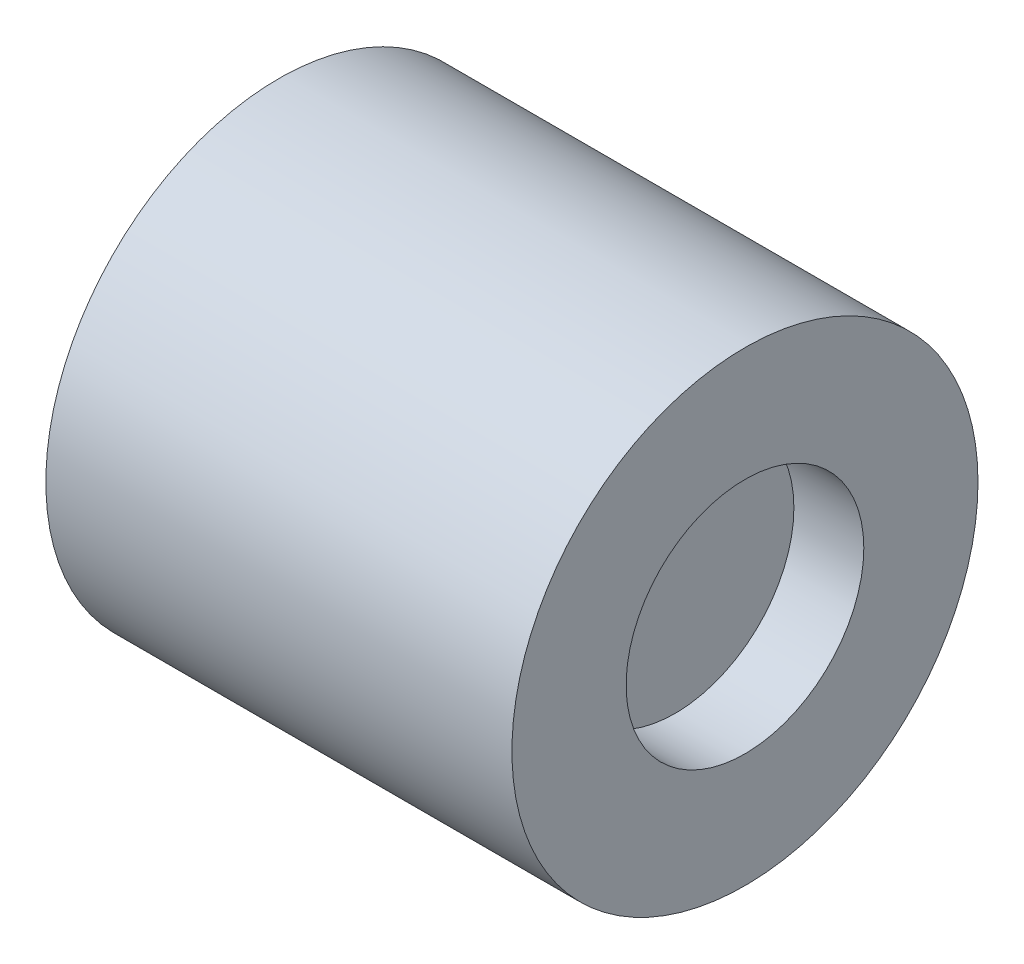
ISO-10303-21;
HEADER;
FILE_DESCRIPTION(('STEP AP214'),'2;1');
FILE_NAME('part.step','',(''),(''),'','','');
FILE_SCHEMA(('AUTOMOTIVE_DESIGN { 1 0 10303 214 1 1 1 1 }'));
ENDSEC;
DATA;
#1=APPLICATION_CONTEXT('core data for automotive mechanical design processes');
#2=APPLICATION_PROTOCOL_DEFINITION('international standard','automotive_design',2000,#1);
#3=PRODUCT_CONTEXT('',#1,'mechanical');
#4=PRODUCT('Part','Part','',(#3));
#5=PRODUCT_RELATED_PRODUCT_CATEGORY('part','',(#4));
#6=PRODUCT_DEFINITION_FORMATION('','',#4);
#7=PRODUCT_DEFINITION_CONTEXT('part definition',#1,'design');
#8=PRODUCT_DEFINITION('design','',#6,#7);
#9=PRODUCT_DEFINITION_SHAPE('','',#8);
#10=(LENGTH_UNIT() NAMED_UNIT(*) SI_UNIT(.MILLI.,.METRE.));
#11=(NAMED_UNIT(*) PLANE_ANGLE_UNIT() SI_UNIT($,.RADIAN.));
#12=(NAMED_UNIT(*) SI_UNIT($,.STERADIAN.) SOLID_ANGLE_UNIT());
#13=UNCERTAINTY_MEASURE_WITH_UNIT(LENGTH_MEASURE(1.E-05),#10,'distance_accuracy_value','');
#14=(GEOMETRIC_REPRESENTATION_CONTEXT(3) GLOBAL_UNCERTAINTY_ASSIGNED_CONTEXT((#13)) GLOBAL_UNIT_ASSIGNED_CONTEXT((#10,
#11,#12)) REPRESENTATION_CONTEXT('',''));
#15=CARTESIAN_POINT('',(0.,0.,0.));
#16=DIRECTION('',(0.,0.,1.));
#17=DIRECTION('',(1.,0.,0.));
#18=AXIS2_PLACEMENT_3D('',#15,#16,#17);
#19=CARTESIAN_POINT('',(10.,0.,0.));
#20=DIRECTION('',(-1.,0.,0.));
#21=DIRECTION('',(0.,0.,1.));
#22=AXIS2_PLACEMENT_3D('',#19,#20,#21);
#23=CYLINDRICAL_SURFACE('',#22,5.);
#24=CARTESIAN_POINT('',(10.,0.,0.));
#25=DIRECTION('',(1.,0.,0.));
#26=DIRECTION('',(0.,0.,-1.));
#27=AXIS2_PLACEMENT_3D('',#24,#25,#26);
#28=CIRCLE('',#27,5.);
#29=CARTESIAN_POINT('',(10.,0.,-5.));
#30=VERTEX_POINT('',#29);
#31=EDGE_CURVE('E10',#30,#30,#28,.T.);
#32=ORIENTED_EDGE('',*,*,#31,.F.);
#33=EDGE_LOOP('',(#32));
#34=FACE_BOUND('',#33,.T.);
#35=CARTESIAN_POINT('',(0.,0.,0.));
#36=DIRECTION('',(1.,0.,0.));
#37=DIRECTION('',(0.,0.,-1.));
#38=AXIS2_PLACEMENT_3D('',#35,#36,#37);
#39=CIRCLE('',#38,5.);
#40=CARTESIAN_POINT('',(0.,0.,-5.));
#41=VERTEX_POINT('',#40);
#42=EDGE_CURVE('E40',#41,#41,#39,.T.);
#43=ORIENTED_EDGE('',*,*,#42,.T.);
#44=EDGE_LOOP('',(#43));
#45=FACE_BOUND('',#44,.T.);
#46=ADVANCED_FACE('F37',(#34,#45),#23,.T.);
#47=CARTESIAN_POINT('',(10.,0.,0.));
#48=DIRECTION('',(1.,0.,0.));
#49=DIRECTION('',(0.,0.,-1.));
#50=AXIS2_PLACEMENT_3D('',#47,#48,#49);
#51=PLANE('',#50);
#52=CARTESIAN_POINT('',(10.,0.,0.));
#53=DIRECTION('',(1.,0.,0.));
#54=DIRECTION('',(0.,0.,-1.));
#55=AXIS2_PLACEMENT_3D('',#52,#53,#54);
#56=CIRCLE('',#55,2.55);
#57=CARTESIAN_POINT('',(10.,0.,-2.55));
#58=VERTEX_POINT('',#57);
#59=EDGE_CURVE('E49',#58,#58,#56,.T.);
#60=ORIENTED_EDGE('',*,*,#59,.F.);
#61=EDGE_LOOP('',(#60));
#62=FACE_BOUND('',#61,.T.);
#63=ORIENTED_EDGE('',*,*,#31,.T.);
#64=EDGE_LOOP('',(#63));
#65=FACE_BOUND('',#64,.T.);
#66=ADVANCED_FACE('F74',(#62,#65),#51,.T.);
#67=CARTESIAN_POINT('',(0.,0.,0.));
#68=DIRECTION('',(1.,0.,0.));
#69=DIRECTION('',(0.,0.,-1.));
#70=AXIS2_PLACEMENT_3D('',#67,#68,#69);
#71=PLANE('',#70);
#72=CARTESIAN_POINT('',(0.,0.,0.));
#73=DIRECTION('',(-1.,0.,0.));
#74=DIRECTION('',(0.,0.,1.));
#75=AXIS2_PLACEMENT_3D('',#72,#73,#74);
#76=CIRCLE('',#75,2.525);
#77=CARTESIAN_POINT('',(0.,0.,2.525));
#78=VERTEX_POINT('',#77);
#79=EDGE_CURVE('E55',#78,#78,#76,.T.);
#80=ORIENTED_EDGE('',*,*,#79,.F.);
#81=EDGE_LOOP('',(#80));
#82=FACE_BOUND('',#81,.T.);
#83=ORIENTED_EDGE('',*,*,#42,.F.);
#84=EDGE_LOOP('',(#83));
#85=FACE_BOUND('',#84,.T.);
#86=ADVANCED_FACE('F70',(#82,#85),#71,.F.);
#87=CARTESIAN_POINT('',(8.5,0.,0.));
#88=DIRECTION('',(1.,0.,0.));
#89=DIRECTION('',(0.,0.,-1.));
#90=AXIS2_PLACEMENT_3D('',#87,#88,#89);
#91=CYLINDRICAL_SURFACE('',#90,2.55);
#92=CARTESIAN_POINT('',(8.5,0.,0.));
#93=DIRECTION('',(1.,0.,0.));
#94=DIRECTION('',(0.,0.,-1.));
#95=AXIS2_PLACEMENT_3D('',#92,#93,#94);
#96=CIRCLE('',#95,2.55);
#97=CARTESIAN_POINT('',(8.5,0.,-2.55));
#98=VERTEX_POINT('',#97);
#99=EDGE_CURVE('E47',#98,#98,#96,.T.);
#100=ORIENTED_EDGE('',*,*,#99,.F.);
#101=EDGE_LOOP('',(#100));
#102=FACE_BOUND('',#101,.T.);
#103=ORIENTED_EDGE('',*,*,#59,.T.);
#104=EDGE_LOOP('',(#103));
#105=FACE_BOUND('',#104,.T.);
#106=ADVANCED_FACE('F73',(#102,#105),#91,.F.);
#107=CARTESIAN_POINT('',(8.5,0.,0.));
#108=DIRECTION('',(1.,0.,0.));
#109=DIRECTION('',(0.,0.,-1.));
#110=AXIS2_PLACEMENT_3D('',#107,#108,#109);
#111=PLANE('',#110);
#112=ORIENTED_EDGE('',*,*,#99,.T.);
#113=EDGE_LOOP('',(#112));
#114=FACE_BOUND('',#113,.T.);
#115=ADVANCED_FACE('F66',(#114),#111,.T.);
#116=CARTESIAN_POINT('',(6.,0.,0.));
#117=DIRECTION('',(-1.,0.,0.));
#118=DIRECTION('',(0.,0.,1.));
#119=AXIS2_PLACEMENT_3D('',#116,#117,#118);
#120=CYLINDRICAL_SURFACE('',#119,2.525);
#121=CARTESIAN_POINT('',(6.,0.,0.));
#122=DIRECTION('',(-1.,0.,0.));
#123=DIRECTION('',(0.,0.,1.));
#124=AXIS2_PLACEMENT_3D('',#121,#122,#123);
#125=CIRCLE('',#124,2.525);
#126=CARTESIAN_POINT('',(6.,0.,2.525));
#127=VERTEX_POINT('',#126);
#128=EDGE_CURVE('E52',#127,#127,#125,.T.);
#129=ORIENTED_EDGE('',*,*,#128,.F.);
#130=EDGE_LOOP('',(#129));
#131=FACE_BOUND('',#130,.T.);
#132=ORIENTED_EDGE('',*,*,#79,.T.);
#133=EDGE_LOOP('',(#132));
#134=FACE_BOUND('',#133,.T.);
#135=ADVANCED_FACE('F63',(#131,#134),#120,.F.);
#136=CARTESIAN_POINT('',(6.,0.,0.));
#137=DIRECTION('',(-1.,0.,0.));
#138=DIRECTION('',(0.,0.,1.));
#139=AXIS2_PLACEMENT_3D('',#136,#137,#138);
#140=PLANE('',#139);
#141=ORIENTED_EDGE('',*,*,#128,.T.);
#142=EDGE_LOOP('',(#141));
#143=FACE_BOUND('',#142,.T.);
#144=ADVANCED_FACE('F61',(#143),#140,.T.);
#145=CLOSED_SHELL('',(#46,#66,#86,#106,#115,#135,#144));
#146=MANIFOLD_SOLID_BREP('B2',#145);
#147=ADVANCED_BREP_SHAPE_REPRESENTATION('',(#18,#146),#14);
#148=SHAPE_DEFINITION_REPRESENTATION(#9,#147);
ENDSEC;
END-ISO-10303-21;
